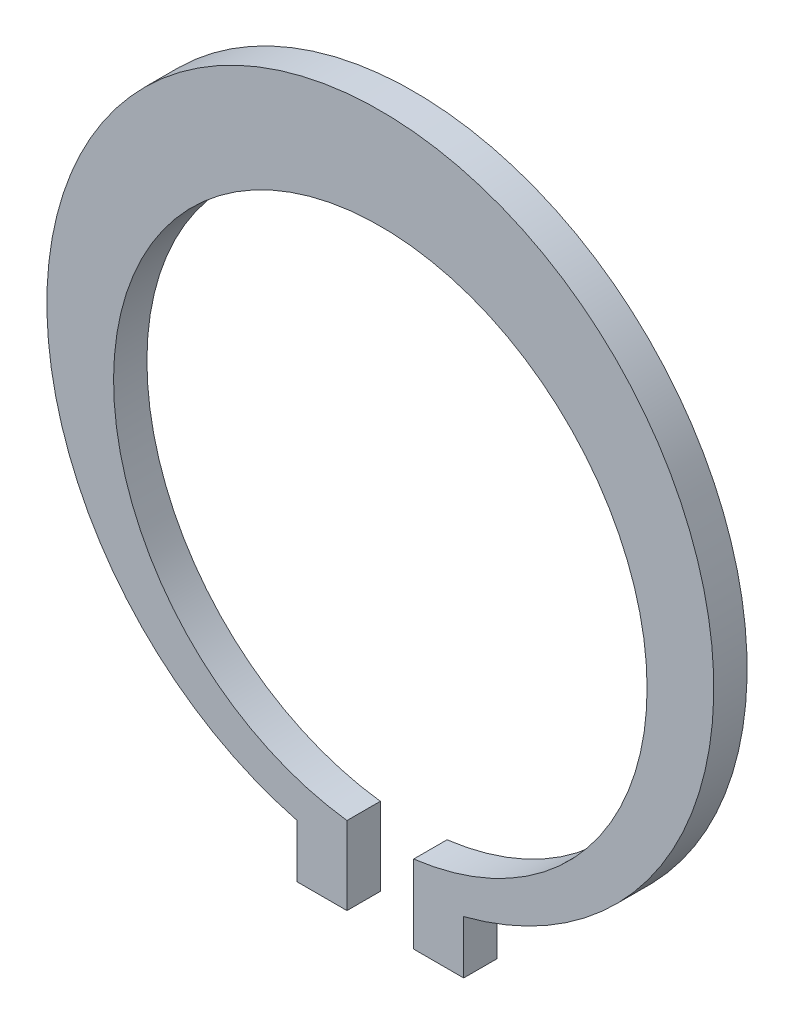
ISO-10303-21;
HEADER;
FILE_DESCRIPTION(('STEP AP214'),'2;1');
FILE_NAME('part.step','',(''),(''),'','','');
FILE_SCHEMA(('AUTOMOTIVE_DESIGN { 1 0 10303 214 1 1 1 1 }'));
ENDSEC;
DATA;
#1=APPLICATION_CONTEXT('core data for automotive mechanical design processes');
#2=APPLICATION_PROTOCOL_DEFINITION('international standard','automotive_design',2000,#1);
#3=PRODUCT_CONTEXT('',#1,'mechanical');
#4=PRODUCT('Part','Part','',(#3));
#5=PRODUCT_RELATED_PRODUCT_CATEGORY('part','',(#4));
#6=PRODUCT_DEFINITION_FORMATION('','',#4);
#7=PRODUCT_DEFINITION_CONTEXT('part definition',#1,'design');
#8=PRODUCT_DEFINITION('design','',#6,#7);
#9=PRODUCT_DEFINITION_SHAPE('','',#8);
#10=(LENGTH_UNIT() NAMED_UNIT(*) SI_UNIT(.MILLI.,.METRE.));
#11=(NAMED_UNIT(*) PLANE_ANGLE_UNIT() SI_UNIT($,.RADIAN.));
#12=(NAMED_UNIT(*) SI_UNIT($,.STERADIAN.) SOLID_ANGLE_UNIT());
#13=UNCERTAINTY_MEASURE_WITH_UNIT(LENGTH_MEASURE(1.E-05),#10,'distance_accuracy_value','');
#14=(GEOMETRIC_REPRESENTATION_CONTEXT(3) GLOBAL_UNCERTAINTY_ASSIGNED_CONTEXT((#13)) GLOBAL_UNIT_ASSIGNED_CONTEXT((#10,
#11,#12)) REPRESENTATION_CONTEXT('',''));
#15=CARTESIAN_POINT('',(0.,0.,0.));
#16=DIRECTION('',(0.,0.,1.));
#17=DIRECTION('',(1.,0.,0.));
#18=AXIS2_PLACEMENT_3D('',#15,#16,#17);
#19=CARTESIAN_POINT('',(5.,0.,2.));
#20=DIRECTION('',(-1.,0.,0.));
#21=DIRECTION('',(0.,0.,1.));
#22=AXIS2_PLACEMENT_3D('',#19,#20,#21);
#23=PLANE('',#22);
#24=DIRECTION('',(0.,1.,0.));
#25=VECTOR('',#24,1.);
#26=CARTESIAN_POINT('',(5.,0.,0.));
#27=LINE('',#26,#25);
#28=CARTESIAN_POINT('',(5.,-22.5545078663875,0.));
#29=VERTEX_POINT('',#28);
#30=CARTESIAN_POINT('',(5.,-19.3649167310371,0.));
#31=VERTEX_POINT('',#30);
#32=EDGE_CURVE('E137',#29,#31,#27,.T.);
#33=ORIENTED_EDGE('',*,*,#32,.T.);
#34=DIRECTION('',(0.,0.,-1.));
#35=VECTOR('',#34,1.);
#36=CARTESIAN_POINT('',(5.,-19.3649167310371,2.));
#37=LINE('',#36,#35);
#38=CARTESIAN_POINT('',(5.,-19.3649167310371,2.));
#39=VERTEX_POINT('',#38);
#40=EDGE_CURVE('E11',#39,#31,#37,.T.);
#41=ORIENTED_EDGE('',*,*,#40,.F.);
#42=DIRECTION('',(0.,1.,0.));
#43=VECTOR('',#42,1.);
#44=CARTESIAN_POINT('',(5.,0.,2.));
#45=LINE('',#44,#43);
#46=CARTESIAN_POINT('',(5.,-22.5545078663875,2.));
#47=VERTEX_POINT('',#46);
#48=EDGE_CURVE('E155',#47,#39,#45,.T.);
#49=ORIENTED_EDGE('',*,*,#48,.F.);
#50=DIRECTION('',(0.,0.,-1.));
#51=VECTOR('',#50,1.);
#52=CARTESIAN_POINT('',(5.,-22.5545078663875,2.));
#53=LINE('',#52,#51);
#54=EDGE_CURVE('E136',#47,#29,#53,.T.);
#55=ORIENTED_EDGE('',*,*,#54,.T.);
#56=EDGE_LOOP('',(#33,#41,#49,#55));
#57=FACE_BOUND('',#56,.T.);
#58=ADVANCED_FACE('F39',(#57),#23,.F.);
#59=CARTESIAN_POINT('',(0.,0.,2.));
#60=DIRECTION('',(0.,0.,-1.));
#61=DIRECTION('',(-1.,0.,0.));
#62=AXIS2_PLACEMENT_3D('',#59,#60,#61);
#63=CYLINDRICAL_SURFACE('',#62,20.);
#64=CARTESIAN_POINT('',(0.,0.,0.));
#65=DIRECTION('',(0.,0.,1.));
#66=DIRECTION('',(1.,0.,0.));
#67=AXIS2_PLACEMENT_3D('',#64,#65,#66);
#68=CIRCLE('',#67,20.);
#69=CARTESIAN_POINT('',(-5.,-19.3649167310371,0.));
#70=VERTEX_POINT('',#69);
#71=EDGE_CURVE('E140',#31,#70,#68,.T.);
#72=ORIENTED_EDGE('',*,*,#71,.T.);
#73=DIRECTION('',(0.,0.,-1.));
#74=VECTOR('',#73,1.);
#75=CARTESIAN_POINT('',(-5.,-19.3649167310371,2.));
#76=LINE('',#75,#74);
#77=CARTESIAN_POINT('',(-5.,-19.3649167310371,2.));
#78=VERTEX_POINT('',#77);
#79=EDGE_CURVE('E47',#78,#70,#76,.T.);
#80=ORIENTED_EDGE('',*,*,#79,.F.);
#81=CARTESIAN_POINT('',(0.,0.,2.));
#82=DIRECTION('',(0.,0.,1.));
#83=DIRECTION('',(1.,0.,0.));
#84=AXIS2_PLACEMENT_3D('',#81,#82,#83);
#85=CIRCLE('',#84,20.);
#86=EDGE_CURVE('E97',#39,#78,#85,.T.);
#87=ORIENTED_EDGE('',*,*,#86,.F.);
#88=ORIENTED_EDGE('',*,*,#40,.T.);
#89=EDGE_LOOP('',(#72,#80,#87,#88));
#90=FACE_BOUND('',#89,.T.);
#91=ADVANCED_FACE('F168',(#90),#63,.T.);
#92=CARTESIAN_POINT('',(-5.,0.,2.));
#93=DIRECTION('',(-1.,0.,0.));
#94=DIRECTION('',(0.,0.,1.));
#95=AXIS2_PLACEMENT_3D('',#92,#93,#94);
#96=PLANE('',#95);
#97=DIRECTION('',(0.,1.,0.));
#98=VECTOR('',#97,1.);
#99=CARTESIAN_POINT('',(-5.,0.,0.));
#100=LINE('',#99,#98);
#101=CARTESIAN_POINT('',(-5.,-22.5545078663875,0.));
#102=VERTEX_POINT('',#101);
#103=EDGE_CURVE('E143',#102,#70,#100,.T.);
#104=ORIENTED_EDGE('',*,*,#103,.F.);
#105=DIRECTION('',(0.,0.,-1.));
#106=VECTOR('',#105,1.);
#107=CARTESIAN_POINT('',(-5.,-22.5545078663875,2.));
#108=LINE('',#107,#106);
#109=CARTESIAN_POINT('',(-5.,-22.5545078663875,2.));
#110=VERTEX_POINT('',#109);
#111=EDGE_CURVE('E161',#110,#102,#108,.T.);
#112=ORIENTED_EDGE('',*,*,#111,.F.);
#113=DIRECTION('',(0.,1.,0.));
#114=VECTOR('',#113,1.);
#115=CARTESIAN_POINT('',(-5.,0.,2.));
#116=LINE('',#115,#114);
#117=EDGE_CURVE('E167',#110,#78,#116,.T.);
#118=ORIENTED_EDGE('',*,*,#117,.T.);
#119=ORIENTED_EDGE('',*,*,#79,.T.);
#120=EDGE_LOOP('',(#104,#112,#118,#119));
#121=FACE_BOUND('',#120,.T.);
#122=ADVANCED_FACE('F165',(#121),#96,.T.);
#123=CARTESIAN_POINT('',(0.,-22.5545078663875,2.));
#124=DIRECTION('',(0.,-1.,0.));
#125=DIRECTION('',(0.,0.,-1.));
#126=AXIS2_PLACEMENT_3D('',#123,#124,#125);
#127=PLANE('',#126);
#128=DIRECTION('',(-1.,0.,0.));
#129=VECTOR('',#128,1.);
#130=CARTESIAN_POINT('',(0.,-22.5545078663875,0.));
#131=LINE('',#130,#129);
#132=CARTESIAN_POINT('',(-2.,-22.5545078663875,0.));
#133=VERTEX_POINT('',#132);
#134=EDGE_CURVE('E146',#133,#102,#131,.T.);
#135=ORIENTED_EDGE('',*,*,#134,.F.);
#136=DIRECTION('',(0.,0.,-1.));
#137=VECTOR('',#136,1.);
#138=CARTESIAN_POINT('',(-2.,-22.5545078663875,2.));
#139=LINE('',#138,#137);
#140=CARTESIAN_POINT('',(-2.,-22.5545078663875,2.));
#141=VERTEX_POINT('',#140);
#142=EDGE_CURVE('E159',#141,#133,#139,.T.);
#143=ORIENTED_EDGE('',*,*,#142,.F.);
#144=DIRECTION('',(-1.,0.,0.));
#145=VECTOR('',#144,1.);
#146=CARTESIAN_POINT('',(0.,-22.5545078663875,2.));
#147=LINE('',#146,#145);
#148=EDGE_CURVE('E131',#141,#110,#147,.T.);
#149=ORIENTED_EDGE('',*,*,#148,.T.);
#150=ORIENTED_EDGE('',*,*,#111,.T.);
#151=EDGE_LOOP('',(#135,#143,#149,#150));
#152=FACE_BOUND('',#151,.T.);
#153=ADVANCED_FACE('F176',(#152),#127,.T.);
#154=CARTESIAN_POINT('',(-2.,0.,2.));
#155=DIRECTION('',(1.,0.,0.));
#156=DIRECTION('',(0.,0.,-1.));
#157=AXIS2_PLACEMENT_3D('',#154,#155,#156);
#158=PLANE('',#157);
#159=DIRECTION('',(0.,-1.,0.));
#160=VECTOR('',#159,1.);
#161=CARTESIAN_POINT('',(-2.,0.,0.));
#162=LINE('',#161,#160);
#163=CARTESIAN_POINT('',(-2.,-17.8745078663875,0.));
#164=VERTEX_POINT('',#163);
#165=EDGE_CURVE('E149',#164,#133,#162,.T.);
#166=ORIENTED_EDGE('',*,*,#165,.F.);
#167=DIRECTION('',(0.,0.,-1.));
#168=VECTOR('',#167,1.);
#169=CARTESIAN_POINT('',(-2.,-17.8745078663875,2.));
#170=LINE('',#169,#168);
#171=CARTESIAN_POINT('',(-2.,-17.8745078663875,2.));
#172=VERTEX_POINT('',#171);
#173=EDGE_CURVE('E119',#172,#164,#170,.T.);
#174=ORIENTED_EDGE('',*,*,#173,.F.);
#175=DIRECTION('',(0.,-1.,0.));
#176=VECTOR('',#175,1.);
#177=CARTESIAN_POINT('',(-2.,0.,2.));
#178=LINE('',#177,#176);
#179=EDGE_CURVE('E129',#172,#141,#178,.T.);
#180=ORIENTED_EDGE('',*,*,#179,.T.);
#181=ORIENTED_EDGE('',*,*,#142,.T.);
#182=EDGE_LOOP('',(#166,#174,#180,#181));
#183=FACE_BOUND('',#182,.T.);
#184=ADVANCED_FACE('F204',(#183),#158,.T.);
#185=CARTESIAN_POINT('',(0.,-2.,2.));
#186=DIRECTION('',(0.,0.,-1.));
#187=DIRECTION('',(-1.,0.,0.));
#188=AXIS2_PLACEMENT_3D('',#185,#186,#187);
#189=CYLINDRICAL_SURFACE('',#188,16.);
#190=CARTESIAN_POINT('',(0.,-2.,0.));
#191=DIRECTION('',(0.,0.,1.));
#192=DIRECTION('',(1.,0.,0.));
#193=AXIS2_PLACEMENT_3D('',#190,#191,#192);
#194=CIRCLE('',#193,16.);
#195=CARTESIAN_POINT('',(2.,-17.8745078663875,0.));
#196=VERTEX_POINT('',#195);
#197=EDGE_CURVE('E118',#196,#164,#194,.T.);
#198=ORIENTED_EDGE('',*,*,#197,.F.);
#199=DIRECTION('',(0.,0.,-1.));
#200=VECTOR('',#199,1.);
#201=CARTESIAN_POINT('',(2.,-17.8745078663875,2.));
#202=LINE('',#201,#200);
#203=CARTESIAN_POINT('',(2.,-17.8745078663875,2.));
#204=VERTEX_POINT('',#203);
#205=EDGE_CURVE('E112',#204,#196,#202,.T.);
#206=ORIENTED_EDGE('',*,*,#205,.F.);
#207=CARTESIAN_POINT('',(0.,-2.,2.));
#208=DIRECTION('',(0.,0.,1.));
#209=DIRECTION('',(1.,0.,0.));
#210=AXIS2_PLACEMENT_3D('',#207,#208,#209);
#211=CIRCLE('',#210,16.);
#212=EDGE_CURVE('E116',#204,#172,#211,.T.);
#213=ORIENTED_EDGE('',*,*,#212,.T.);
#214=ORIENTED_EDGE('',*,*,#173,.T.);
#215=EDGE_LOOP('',(#198,#206,#213,#214));
#216=FACE_BOUND('',#215,.T.);
#217=ADVANCED_FACE('F114',(#216),#189,.F.);
#218=CARTESIAN_POINT('',(2.,0.,2.));
#219=DIRECTION('',(1.,0.,0.));
#220=DIRECTION('',(0.,0.,-1.));
#221=AXIS2_PLACEMENT_3D('',#218,#219,#220);
#222=PLANE('',#221);
#223=DIRECTION('',(0.,-1.,0.));
#224=VECTOR('',#223,1.);
#225=CARTESIAN_POINT('',(2.,0.,0.));
#226=LINE('',#225,#224);
#227=CARTESIAN_POINT('',(2.,-22.5545078663875,0.));
#228=VERTEX_POINT('',#227);
#229=EDGE_CURVE('E83',#196,#228,#226,.T.);
#230=ORIENTED_EDGE('',*,*,#229,.T.);
#231=DIRECTION('',(0.,0.,-1.));
#232=VECTOR('',#231,1.);
#233=CARTESIAN_POINT('',(2.,-22.5545078663875,2.));
#234=LINE('',#233,#232);
#235=CARTESIAN_POINT('',(2.,-22.5545078663875,2.));
#236=VERTEX_POINT('',#235);
#237=EDGE_CURVE('E120',#236,#228,#234,.T.);
#238=ORIENTED_EDGE('',*,*,#237,.F.);
#239=DIRECTION('',(0.,-1.,0.));
#240=VECTOR('',#239,1.);
#241=CARTESIAN_POINT('',(2.,0.,2.));
#242=LINE('',#241,#240);
#243=EDGE_CURVE('E122',#204,#236,#242,.T.);
#244=ORIENTED_EDGE('',*,*,#243,.F.);
#245=ORIENTED_EDGE('',*,*,#205,.T.);
#246=EDGE_LOOP('',(#230,#238,#244,#245));
#247=FACE_BOUND('',#246,.T.);
#248=ADVANCED_FACE('F123',(#247),#222,.F.);
#249=CARTESIAN_POINT('',(0.,-22.5545078663875,2.));
#250=DIRECTION('',(0.,1.,0.));
#251=DIRECTION('',(0.,0.,1.));
#252=AXIS2_PLACEMENT_3D('',#249,#250,#251);
#253=PLANE('',#252);
#254=DIRECTION('',(1.,0.,0.));
#255=VECTOR('',#254,1.);
#256=CARTESIAN_POINT('',(0.,-22.5545078663875,0.));
#257=LINE('',#256,#255);
#258=EDGE_CURVE('E89',#228,#29,#257,.T.);
#259=ORIENTED_EDGE('',*,*,#258,.T.);
#260=ORIENTED_EDGE('',*,*,#54,.F.);
#261=DIRECTION('',(1.,0.,0.));
#262=VECTOR('',#261,1.);
#263=CARTESIAN_POINT('',(0.,-22.5545078663875,2.));
#264=LINE('',#263,#262);
#265=EDGE_CURVE('E55',#236,#47,#264,.T.);
#266=ORIENTED_EDGE('',*,*,#265,.F.);
#267=ORIENTED_EDGE('',*,*,#237,.T.);
#268=EDGE_LOOP('',(#259,#260,#266,#267));
#269=FACE_BOUND('',#268,.T.);
#270=ADVANCED_FACE('F183',(#269),#253,.F.);
#271=CARTESIAN_POINT('',(0.,0.,2.));
#272=DIRECTION('',(0.,0.,1.));
#273=DIRECTION('',(1.,0.,0.));
#274=AXIS2_PLACEMENT_3D('',#271,#272,#273);
#275=PLANE('',#274);
#276=ORIENTED_EDGE('',*,*,#48,.T.);
#277=ORIENTED_EDGE('',*,*,#86,.T.);
#278=ORIENTED_EDGE('',*,*,#117,.F.);
#279=ORIENTED_EDGE('',*,*,#148,.F.);
#280=ORIENTED_EDGE('',*,*,#179,.F.);
#281=ORIENTED_EDGE('',*,*,#212,.F.);
#282=ORIENTED_EDGE('',*,*,#243,.T.);
#283=ORIENTED_EDGE('',*,*,#265,.T.);
#284=EDGE_LOOP('',(#276,#277,#278,#279,#280,#281,#282,#283));
#285=FACE_BOUND('',#284,.T.);
#286=ADVANCED_FACE('F126',(#285),#275,.T.);
#287=CARTESIAN_POINT('',(0.,0.,0.));
#288=DIRECTION('',(0.,0.,1.));
#289=DIRECTION('',(1.,0.,0.));
#290=AXIS2_PLACEMENT_3D('',#287,#288,#289);
#291=PLANE('',#290);
#292=ORIENTED_EDGE('',*,*,#32,.F.);
#293=ORIENTED_EDGE('',*,*,#258,.F.);
#294=ORIENTED_EDGE('',*,*,#229,.F.);
#295=ORIENTED_EDGE('',*,*,#197,.T.);
#296=ORIENTED_EDGE('',*,*,#165,.T.);
#297=ORIENTED_EDGE('',*,*,#134,.T.);
#298=ORIENTED_EDGE('',*,*,#103,.T.);
#299=ORIENTED_EDGE('',*,*,#71,.F.);
#300=EDGE_LOOP('',(#292,#293,#294,#295,#296,#297,#298,#299));
#301=FACE_BOUND('',#300,.T.);
#302=ADVANCED_FACE('F172',(#301),#291,.F.);
#303=CLOSED_SHELL('',(#58,#91,#122,#153,#184,#217,#248,#270,#286,#302));
#304=MANIFOLD_SOLID_BREP('B2',#303);
#305=ADVANCED_BREP_SHAPE_REPRESENTATION('',(#18,#304),#14);
#306=SHAPE_DEFINITION_REPRESENTATION(#9,#305);
ENDSEC;
END-ISO-10303-21;
